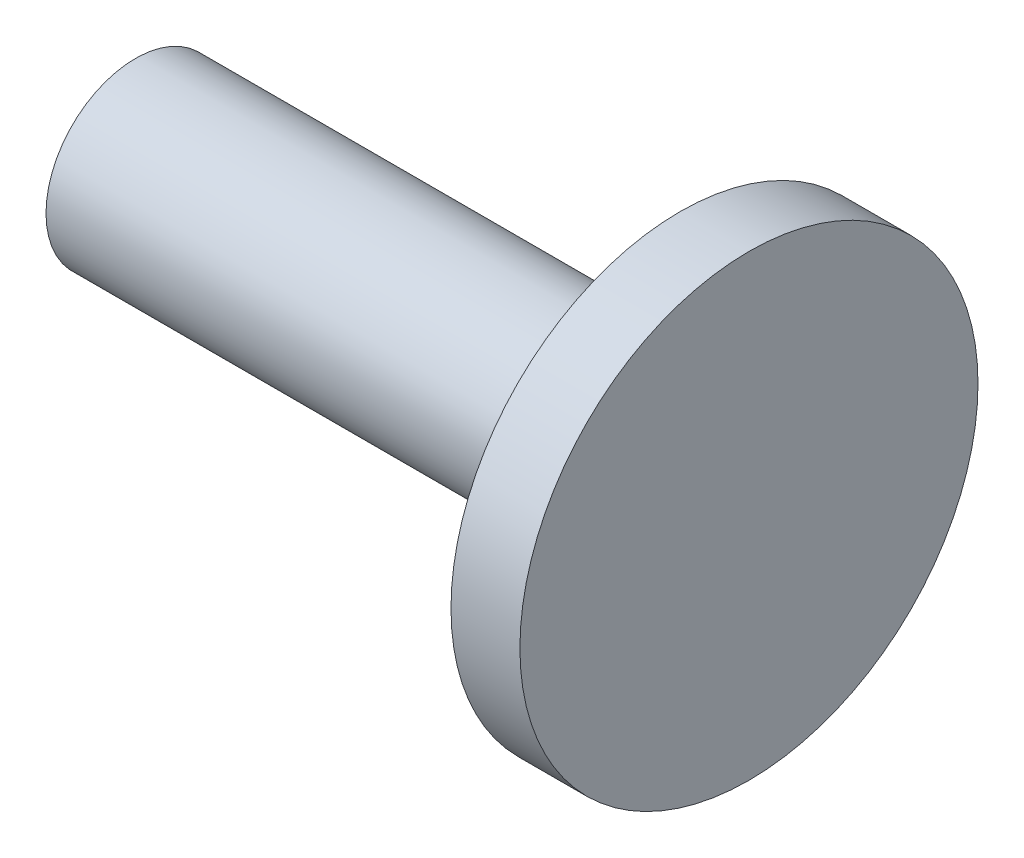
ISO-10303-21;
HEADER;
FILE_DESCRIPTION(('STEP AP214'),'2;1');
FILE_NAME('part.step','',(''),(''),'','','');
FILE_SCHEMA(('AUTOMOTIVE_DESIGN { 1 0 10303 214 1 1 1 1 }'));
ENDSEC;
DATA;
#1=APPLICATION_CONTEXT('core data for automotive mechanical design processes');
#2=APPLICATION_PROTOCOL_DEFINITION('international standard','automotive_design',2000,#1);
#3=PRODUCT_CONTEXT('',#1,'mechanical');
#4=PRODUCT('Part','Part','',(#3));
#5=PRODUCT_RELATED_PRODUCT_CATEGORY('part','',(#4));
#6=PRODUCT_DEFINITION_FORMATION('','',#4);
#7=PRODUCT_DEFINITION_CONTEXT('part definition',#1,'design');
#8=PRODUCT_DEFINITION('design','',#6,#7);
#9=PRODUCT_DEFINITION_SHAPE('','',#8);
#10=(LENGTH_UNIT() NAMED_UNIT(*) SI_UNIT(.MILLI.,.METRE.));
#11=(NAMED_UNIT(*) PLANE_ANGLE_UNIT() SI_UNIT($,.RADIAN.));
#12=(NAMED_UNIT(*) SI_UNIT($,.STERADIAN.) SOLID_ANGLE_UNIT());
#13=UNCERTAINTY_MEASURE_WITH_UNIT(LENGTH_MEASURE(1.E-05),#10,'distance_accuracy_value','');
#14=(GEOMETRIC_REPRESENTATION_CONTEXT(3) GLOBAL_UNCERTAINTY_ASSIGNED_CONTEXT((#13)) GLOBAL_UNIT_ASSIGNED_CONTEXT((#10,
#11,#12)) REPRESENTATION_CONTEXT('',''));
#15=CARTESIAN_POINT('',(0.,0.,0.));
#16=DIRECTION('',(0.,0.,1.));
#17=DIRECTION('',(1.,0.,0.));
#18=AXIS2_PLACEMENT_3D('',#15,#16,#17);
#19=CARTESIAN_POINT('',(-11.826874999997,0.,0.));
#20=DIRECTION('',(-1.,0.,0.));
#21=DIRECTION('',(0.,0.,1.));
#22=AXIS2_PLACEMENT_3D('',#19,#20,#21);
#23=CONICAL_SURFACE('',#22,1.98373999995738,1.04719755119397);
#24=CARTESIAN_POINT('',(-10.6815621770124,0.,0.));
#25=VERTEX_POINT('',#24);
#26=VERTEX_LOOP('',#25);
#27=FACE_BOUND('',#26,.T.);
#28=CARTESIAN_POINT('',(-11.826875,0.,0.));
#29=DIRECTION('',(-1.,0.,0.));
#30=DIRECTION('',(0.,0.,1.));
#31=AXIS2_PLACEMENT_3D('',#28,#29,#30);
#32=CIRCLE('',#31,1.98374);
#33=CARTESIAN_POINT('',(-11.826875,0.,1.98374));
#34=VERTEX_POINT('',#33);
#35=EDGE_CURVE('E32',#34,#34,#32,.T.);
#36=ORIENTED_EDGE('',*,*,#35,.T.);
#37=EDGE_LOOP('',(#36));
#38=FACE_BOUND('',#37,.T.);
#39=ADVANCED_FACE('F16',(#27,#38),#23,.F.);
#40=CARTESIAN_POINT('',(7.76605,10.16,0.));
#41=DIRECTION('',(-1.,0.,0.));
#42=DIRECTION('',(0.,0.,1.));
#43=AXIS2_PLACEMENT_3D('',#40,#41,#42);
#44=PLANE('',#43);
#45=CARTESIAN_POINT('',(7.76605,0.,0.));
#46=DIRECTION('',(-1.,0.,0.));
#47=DIRECTION('',(0.,0.,1.));
#48=AXIS2_PLACEMENT_3D('',#45,#46,#47);
#49=CIRCLE('',#48,10.16);
#50=CARTESIAN_POINT('',(7.76605,0.,10.16));
#51=VERTEX_POINT('',#50);
#52=EDGE_CURVE('E19',#51,#51,#49,.T.);
#53=ORIENTED_EDGE('',*,*,#52,.F.);
#54=EDGE_LOOP('',(#53));
#55=FACE_BOUND('',#54,.T.);
#56=ADVANCED_FACE('F29',(#55),#44,.F.);
#57=CARTESIAN_POINT('',(-10.6815621769978,0.,0.));
#58=DIRECTION('',(-1.,0.,0.));
#59=DIRECTION('',(0.,0.,1.));
#60=AXIS2_PLACEMENT_3D('',#57,#58,#59);
#61=CYLINDRICAL_SURFACE('',#60,1.98374);
#62=CARTESIAN_POINT('',(-19.0176149999957,0.,0.));
#63=DIRECTION('',(-1.,0.,0.));
#64=DIRECTION('',(0.,0.,1.));
#65=AXIS2_PLACEMENT_3D('',#62,#63,#64);
#66=CIRCLE('',#65,1.98373999995738);
#67=CARTESIAN_POINT('',(-19.0176149999957,0.,1.98373999995738));
#68=VERTEX_POINT('',#67);
#69=EDGE_CURVE('E36',#68,#68,#66,.T.);
#70=ORIENTED_EDGE('',*,*,#69,.T.);
#71=EDGE_LOOP('',(#70));
#72=FACE_BOUND('',#71,.T.);
#73=ORIENTED_EDGE('',*,*,#35,.F.);
#74=EDGE_LOOP('',(#73));
#75=FACE_BOUND('',#74,.T.);
#76=ADVANCED_FACE('F54',(#72,#75),#61,.F.);
#77=CARTESIAN_POINT('',(7.76605,0.,0.));
#78=DIRECTION('',(-1.,0.,0.));
#79=DIRECTION('',(0.,0.,1.));
#80=AXIS2_PLACEMENT_3D('',#77,#78,#79);
#81=CYLINDRICAL_SURFACE('',#80,10.16);
#82=CARTESIAN_POINT('',(4.708525,0.,0.));
#83=DIRECTION('',(-1.,0.,0.));
#84=DIRECTION('',(0.,0.,1.));
#85=AXIS2_PLACEMENT_3D('',#82,#83,#84);
#86=CIRCLE('',#85,10.16);
#87=CARTESIAN_POINT('',(4.708525,0.,10.16));
#88=VERTEX_POINT('',#87);
#89=EDGE_CURVE('E47',#88,#88,#86,.F.);
#90=ORIENTED_EDGE('',*,*,#89,.T.);
#91=EDGE_LOOP('',(#90));
#92=FACE_BOUND('',#91,.T.);
#93=ORIENTED_EDGE('',*,*,#52,.T.);
#94=EDGE_LOOP('',(#93));
#95=FACE_BOUND('',#94,.T.);
#96=ADVANCED_FACE('F59',(#92,#95),#81,.T.);
#97=CARTESIAN_POINT('',(-19.4468749999714,0.,0.));
#98=DIRECTION('',(-1.,0.,0.));
#99=DIRECTION('',(0.,0.,1.));
#100=AXIS2_PLACEMENT_3D('',#97,#98,#99);
#101=CONICAL_SURFACE('',#100,2.41299999987632,0.785398163397448);
#102=CARTESIAN_POINT('',(-19.4468750000283,0.,0.));
#103=DIRECTION('',(-1.,0.,0.));
#104=DIRECTION('',(0.,0.,1.));
#105=AXIS2_PLACEMENT_3D('',#102,#103,#104);
#106=CIRCLE('',#105,2.41299999993316);
#107=CARTESIAN_POINT('',(-19.4468750000283,0.,2.41299999993316));
#108=VERTEX_POINT('',#107);
#109=EDGE_CURVE('E45',#108,#108,#106,.T.);
#110=ORIENTED_EDGE('',*,*,#109,.T.);
#111=EDGE_LOOP('',(#110));
#112=FACE_BOUND('',#111,.T.);
#113=ORIENTED_EDGE('',*,*,#69,.F.);
#114=EDGE_LOOP('',(#113));
#115=FACE_BOUND('',#114,.T.);
#116=ADVANCED_FACE('F56',(#112,#115),#101,.F.);
#117=CARTESIAN_POINT('',(4.708525,3.96875,0.));
#118=DIRECTION('',(1.,0.,0.));
#119=DIRECTION('',(0.,0.,-1.));
#120=AXIS2_PLACEMENT_3D('',#117,#118,#119);
#121=PLANE('',#120);
#122=CARTESIAN_POINT('',(4.708525,0.,0.));
#123=DIRECTION('',(-1.,0.,0.));
#124=DIRECTION('',(0.,0.,1.));
#125=AXIS2_PLACEMENT_3D('',#122,#123,#124);
#126=CIRCLE('',#125,3.96875);
#127=CARTESIAN_POINT('',(4.708525,0.,3.96875));
#128=VERTEX_POINT('',#127);
#129=EDGE_CURVE('E23',#128,#128,#126,.T.);
#130=ORIENTED_EDGE('',*,*,#129,.F.);
#131=EDGE_LOOP('',(#130));
#132=FACE_BOUND('',#131,.T.);
#133=ORIENTED_EDGE('',*,*,#89,.F.);
#134=EDGE_LOOP('',(#133));
#135=FACE_BOUND('',#134,.T.);
#136=ADVANCED_FACE('F58',(#132,#135),#121,.F.);
#137=CARTESIAN_POINT('',(-19.446875,0.,0.));
#138=DIRECTION('',(1.,0.,0.));
#139=DIRECTION('',(0.,0.,-1.));
#140=AXIS2_PLACEMENT_3D('',#137,#138,#139);
#141=PLANE('',#140);
#142=ORIENTED_EDGE('',*,*,#109,.F.);
#143=EDGE_LOOP('',(#142));
#144=FACE_BOUND('',#143,.T.);
#145=CARTESIAN_POINT('',(-19.446875,0.,0.));
#146=DIRECTION('',(-1.,0.,0.));
#147=DIRECTION('',(0.,0.,1.));
#148=AXIS2_PLACEMENT_3D('',#145,#146,#147);
#149=CIRCLE('',#148,3.96875);
#150=CARTESIAN_POINT('',(-19.446875,0.,3.96875));
#151=VERTEX_POINT('',#150);
#152=EDGE_CURVE('E10',#151,#151,#149,.F.);
#153=ORIENTED_EDGE('',*,*,#152,.F.);
#154=EDGE_LOOP('',(#153));
#155=FACE_BOUND('',#154,.T.);
#156=ADVANCED_FACE('F67',(#144,#155),#141,.F.);
#157=CARTESIAN_POINT('',(7.76605,0.,0.));
#158=DIRECTION('',(-1.,0.,0.));
#159=DIRECTION('',(0.,0.,1.));
#160=AXIS2_PLACEMENT_3D('',#157,#158,#159);
#161=CYLINDRICAL_SURFACE('',#160,3.96875);
#162=ORIENTED_EDGE('',*,*,#152,.T.);
#163=EDGE_LOOP('',(#162));
#164=FACE_BOUND('',#163,.T.);
#165=ORIENTED_EDGE('',*,*,#129,.T.);
#166=EDGE_LOOP('',(#165));
#167=FACE_BOUND('',#166,.T.);
#168=ADVANCED_FACE('F71',(#164,#167),#161,.T.);
#169=CLOSED_SHELL('',(#39,#56,#76,#96,#116,#136,#156,#168));
#170=MANIFOLD_SOLID_BREP('B1',#169);
#171=ADVANCED_BREP_SHAPE_REPRESENTATION('',(#18,#170),#14);
#172=SHAPE_DEFINITION_REPRESENTATION(#9,#171);
ENDSEC;
END-ISO-10303-21;
